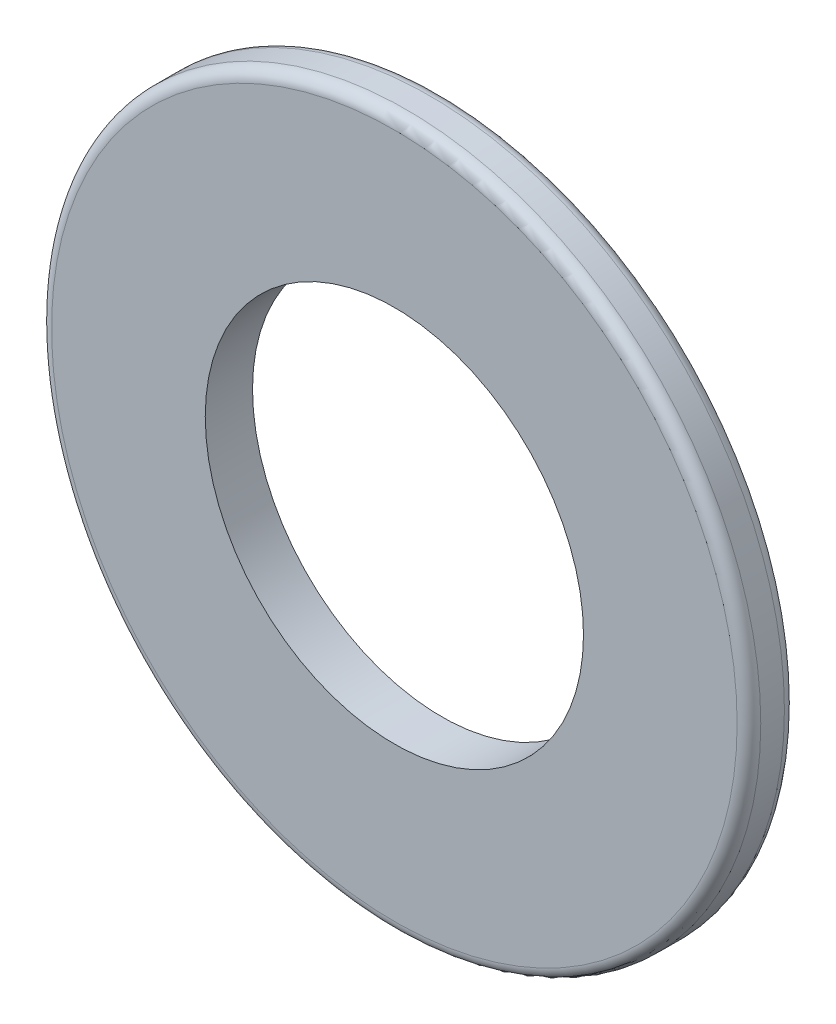
ISO-10303-21;
HEADER;
FILE_DESCRIPTION(('STEP AP214'),'2;1');
FILE_NAME('part.step','',(''),(''),'','','');
FILE_SCHEMA(('AUTOMOTIVE_DESIGN { 1 0 10303 214 1 1 1 1 }'));
ENDSEC;
DATA;
#1=APPLICATION_CONTEXT('core data for automotive mechanical design processes');
#2=APPLICATION_PROTOCOL_DEFINITION('international standard','automotive_design',2000,#1);
#3=PRODUCT_CONTEXT('',#1,'mechanical');
#4=PRODUCT('Part','Part','',(#3));
#5=PRODUCT_RELATED_PRODUCT_CATEGORY('part','',(#4));
#6=PRODUCT_DEFINITION_FORMATION('','',#4);
#7=PRODUCT_DEFINITION_CONTEXT('part definition',#1,'design');
#8=PRODUCT_DEFINITION('design','',#6,#7);
#9=PRODUCT_DEFINITION_SHAPE('','',#8);
#10=(LENGTH_UNIT() NAMED_UNIT(*) SI_UNIT(.MILLI.,.METRE.));
#11=(NAMED_UNIT(*) PLANE_ANGLE_UNIT() SI_UNIT($,.RADIAN.));
#12=(NAMED_UNIT(*) SI_UNIT($,.STERADIAN.) SOLID_ANGLE_UNIT());
#13=UNCERTAINTY_MEASURE_WITH_UNIT(LENGTH_MEASURE(1.E-05),#10,'distance_accuracy_value','');
#14=(GEOMETRIC_REPRESENTATION_CONTEXT(3) GLOBAL_UNCERTAINTY_ASSIGNED_CONTEXT((#13)) GLOBAL_UNIT_ASSIGNED_CONTEXT((#10,
#11,#12)) REPRESENTATION_CONTEXT('',''));
#15=CARTESIAN_POINT('',(0.,0.,0.));
#16=DIRECTION('',(0.,0.,1.));
#17=DIRECTION('',(1.,0.,0.));
#18=AXIS2_PLACEMENT_3D('',#15,#16,#17);
#19=CARTESIAN_POINT('',(0.,0.,1.));
#20=DIRECTION('',(0.,0.,1.));
#21=DIRECTION('',(1.,0.,0.));
#22=AXIS2_PLACEMENT_3D('',#19,#20,#21);
#23=PLANE('',#22);
#24=CARTESIAN_POINT('',(0.,0.,1.));
#25=DIRECTION('',(0.,0.,1.));
#26=DIRECTION('',(1.,0.,0.));
#27=AXIS2_PLACEMENT_3D('',#24,#25,#26);
#28=CIRCLE('',#27,7.25);
#29=CARTESIAN_POINT('',(7.25,0.,1.));
#30=VERTEX_POINT('',#29);
#31=EDGE_CURVE('E10',#30,#30,#28,.T.);
#32=ORIENTED_EDGE('',*,*,#31,.T.);
#33=EDGE_LOOP('',(#32));
#34=FACE_BOUND('',#33,.T.);
#35=CARTESIAN_POINT('',(0.,0.,1.));
#36=DIRECTION('',(0.,0.,1.));
#37=DIRECTION('',(1.,0.,0.));
#38=AXIS2_PLACEMENT_3D('',#35,#36,#37);
#39=CIRCLE('',#38,4.);
#40=CARTESIAN_POINT('',(4.,0.,1.));
#41=VERTEX_POINT('',#40);
#42=EDGE_CURVE('E51',#41,#41,#39,.T.);
#43=ORIENTED_EDGE('',*,*,#42,.F.);
#44=EDGE_LOOP('',(#43));
#45=FACE_BOUND('',#44,.T.);
#46=ADVANCED_FACE('F31',(#34,#45),#23,.T.);
#47=CARTESIAN_POINT('',(0.,0.,0.));
#48=DIRECTION('',(0.,0.,1.));
#49=DIRECTION('',(1.,0.,0.));
#50=AXIS2_PLACEMENT_3D('',#47,#48,#49);
#51=PLANE('',#50);
#52=CARTESIAN_POINT('',(0.,0.,0.));
#53=DIRECTION('',(0.,0.,1.));
#54=DIRECTION('',(1.,0.,0.));
#55=AXIS2_PLACEMENT_3D('',#52,#53,#54);
#56=CIRCLE('',#55,7.25);
#57=CARTESIAN_POINT('',(7.25,0.,0.));
#58=VERTEX_POINT('',#57);
#59=EDGE_CURVE('E38',#58,#58,#56,.F.);
#60=ORIENTED_EDGE('',*,*,#59,.T.);
#61=EDGE_LOOP('',(#60));
#62=FACE_BOUND('',#61,.T.);
#63=CARTESIAN_POINT('',(0.,0.,0.));
#64=DIRECTION('',(0.,0.,1.));
#65=DIRECTION('',(1.,0.,0.));
#66=AXIS2_PLACEMENT_3D('',#63,#64,#65);
#67=CIRCLE('',#66,4.);
#68=CARTESIAN_POINT('',(4.,0.,0.));
#69=VERTEX_POINT('',#68);
#70=EDGE_CURVE('E52',#69,#69,#67,.T.);
#71=ORIENTED_EDGE('',*,*,#70,.T.);
#72=EDGE_LOOP('',(#71));
#73=FACE_BOUND('',#72,.T.);
#74=ADVANCED_FACE('F62',(#62,#73),#51,.F.);
#75=CARTESIAN_POINT('',(0.,0.,1.));
#76=DIRECTION('',(0.,0.,-1.));
#77=DIRECTION('',(-1.,0.,0.));
#78=AXIS2_PLACEMENT_3D('',#75,#76,#77);
#79=CYLINDRICAL_SURFACE('',#78,7.5);
#80=CARTESIAN_POINT('',(0.,0.,0.25));
#81=DIRECTION('',(0.,0.,1.));
#82=DIRECTION('',(1.,0.,0.));
#83=AXIS2_PLACEMENT_3D('',#80,#81,#82);
#84=CIRCLE('',#83,7.5);
#85=CARTESIAN_POINT('',(7.5,0.,0.25));
#86=VERTEX_POINT('',#85);
#87=EDGE_CURVE('E42',#86,#86,#84,.T.);
#88=ORIENTED_EDGE('',*,*,#87,.T.);
#89=EDGE_LOOP('',(#88));
#90=FACE_BOUND('',#89,.T.);
#91=CARTESIAN_POINT('',(0.,0.,0.75));
#92=DIRECTION('',(0.,0.,1.));
#93=DIRECTION('',(1.,0.,0.));
#94=AXIS2_PLACEMENT_3D('',#91,#92,#93);
#95=CIRCLE('',#94,7.5);
#96=CARTESIAN_POINT('',(7.5,0.,0.75));
#97=VERTEX_POINT('',#96);
#98=EDGE_CURVE('E46',#97,#97,#95,.F.);
#99=ORIENTED_EDGE('',*,*,#98,.T.);
#100=EDGE_LOOP('',(#99));
#101=FACE_BOUND('',#100,.T.);
#102=ADVANCED_FACE('F67',(#90,#101),#79,.T.);
#103=CARTESIAN_POINT('',(0.,0.,1.));
#104=DIRECTION('',(0.,0.,-1.));
#105=DIRECTION('',(-1.,0.,0.));
#106=AXIS2_PLACEMENT_3D('',#103,#104,#105);
#107=CYLINDRICAL_SURFACE('',#106,4.);
#108=ORIENTED_EDGE('',*,*,#42,.T.);
#109=EDGE_LOOP('',(#108));
#110=FACE_BOUND('',#109,.T.);
#111=ORIENTED_EDGE('',*,*,#70,.F.);
#112=EDGE_LOOP('',(#111));
#113=FACE_BOUND('',#112,.T.);
#114=ADVANCED_FACE('F58',(#110,#113),#107,.F.);
#115=CARTESIAN_POINT('',(0.,0.,0.25));
#116=DIRECTION('',(0.,0.,1.));
#117=DIRECTION('',(1.,0.,0.));
#118=AXIS2_PLACEMENT_3D('',#115,#116,#117);
#119=TOROIDAL_SURFACE('',#118,7.25,0.25);
#120=ORIENTED_EDGE('',*,*,#59,.F.);
#121=EDGE_LOOP('',(#120));
#122=FACE_BOUND('',#121,.T.);
#123=ORIENTED_EDGE('',*,*,#87,.F.);
#124=EDGE_LOOP('',(#123));
#125=FACE_BOUND('',#124,.T.);
#126=ADVANCED_FACE('F73',(#122,#125),#119,.T.);
#127=CARTESIAN_POINT('',(0.,0.,0.75));
#128=DIRECTION('',(0.,0.,1.));
#129=DIRECTION('',(1.,0.,0.));
#130=AXIS2_PLACEMENT_3D('',#127,#128,#129);
#131=TOROIDAL_SURFACE('',#130,7.25,0.25);
#132=ORIENTED_EDGE('',*,*,#98,.F.);
#133=EDGE_LOOP('',(#132));
#134=FACE_BOUND('',#133,.T.);
#135=ORIENTED_EDGE('',*,*,#31,.F.);
#136=EDGE_LOOP('',(#135));
#137=FACE_BOUND('',#136,.T.);
#138=ADVANCED_FACE('F33',(#134,#137),#131,.T.);
#139=CLOSED_SHELL('',(#46,#74,#102,#114,#126,#138));
#140=MANIFOLD_SOLID_BREP('B2',#139);
#141=ADVANCED_BREP_SHAPE_REPRESENTATION('',(#18,#140),#14);
#142=SHAPE_DEFINITION_REPRESENTATION(#9,#141);
ENDSEC;
END-ISO-10303-21;
